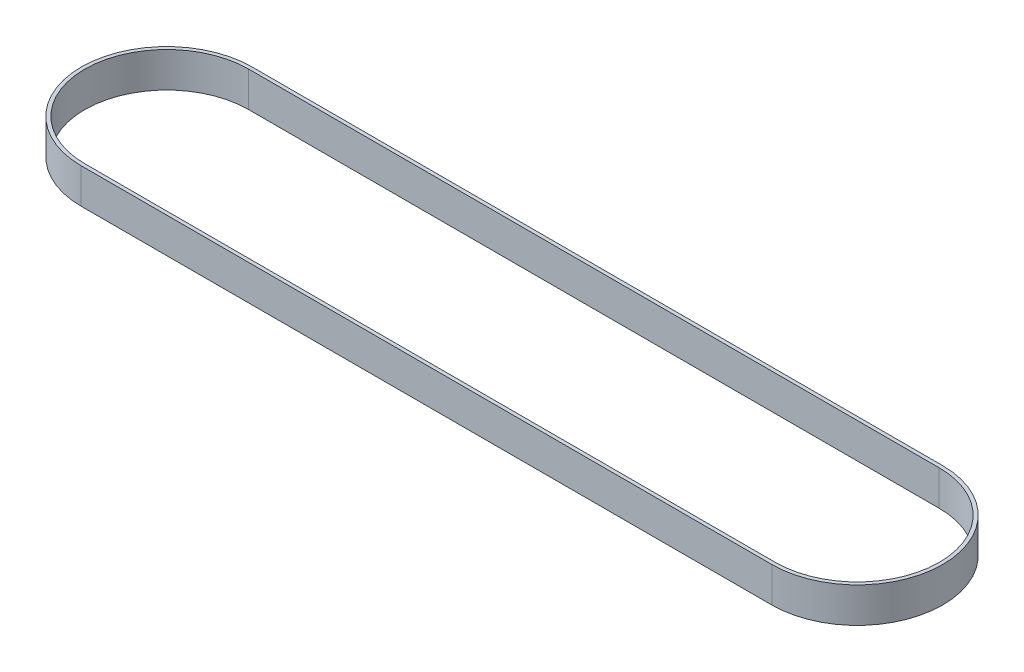
ISO-10303-21;
HEADER;
FILE_DESCRIPTION(('STEP AP214'),'2;1');
FILE_NAME('part.step','',(''),(''),'','','');
FILE_SCHEMA(('AUTOMOTIVE_DESIGN { 1 0 10303 214 1 1 1 1 }'));
ENDSEC;
DATA;
#1=APPLICATION_CONTEXT('core data for automotive mechanical design processes');
#2=APPLICATION_PROTOCOL_DEFINITION('international standard','automotive_design',2000,#1);
#3=PRODUCT_CONTEXT('',#1,'mechanical');
#4=PRODUCT('Part','Part','',(#3));
#5=PRODUCT_RELATED_PRODUCT_CATEGORY('part','',(#4));
#6=PRODUCT_DEFINITION_FORMATION('','',#4);
#7=PRODUCT_DEFINITION_CONTEXT('part definition',#1,'design');
#8=PRODUCT_DEFINITION('design','',#6,#7);
#9=PRODUCT_DEFINITION_SHAPE('','',#8);
#10=(LENGTH_UNIT() NAMED_UNIT(*) SI_UNIT(.MILLI.,.METRE.));
#11=(NAMED_UNIT(*) PLANE_ANGLE_UNIT() SI_UNIT($,.RADIAN.));
#12=(NAMED_UNIT(*) SI_UNIT($,.STERADIAN.) SOLID_ANGLE_UNIT());
#13=UNCERTAINTY_MEASURE_WITH_UNIT(LENGTH_MEASURE(1.E-05),#10,'distance_accuracy_value','');
#14=(GEOMETRIC_REPRESENTATION_CONTEXT(3) GLOBAL_UNCERTAINTY_ASSIGNED_CONTEXT((#13)) GLOBAL_UNIT_ASSIGNED_CONTEXT((#10,
#11,#12)) REPRESENTATION_CONTEXT('',''));
#15=CARTESIAN_POINT('',(0.,0.,0.));
#16=DIRECTION('',(0.,0.,1.));
#17=DIRECTION('',(1.,0.,0.));
#18=AXIS2_PLACEMENT_3D('',#15,#16,#17);
#19=CARTESIAN_POINT('',(0.,15.,-36.5379));
#20=DIRECTION('',(0.,0.,1.));
#21=DIRECTION('',(1.,0.,0.));
#22=AXIS2_PLACEMENT_3D('',#19,#20,#21);
#23=PLANE('',#22);
#24=DIRECTION('',(0.,-1.,0.));
#25=VECTOR('',#24,1.);
#26=CARTESIAN_POINT('',(0.,15.,-36.5379));
#27=LINE('',#26,#25);
#28=CARTESIAN_POINT('',(0.,15.,-36.5379));
#29=VERTEX_POINT('',#28);
#30=CARTESIAN_POINT('',(0.,0.,-36.5379));
#31=VERTEX_POINT('',#30);
#32=EDGE_CURVE('E63',#29,#31,#27,.T.);
#33=ORIENTED_EDGE('',*,*,#32,.F.);
#34=DIRECTION('',(1.,0.,0.));
#35=VECTOR('',#34,1.);
#36=CARTESIAN_POINT('',(0.,15.,-36.5379));
#37=LINE('',#36,#35);
#38=CARTESIAN_POINT('',(295.0718,15.,-36.5379));
#39=VERTEX_POINT('',#38);
#40=EDGE_CURVE('E65',#39,#29,#37,.F.);
#41=ORIENTED_EDGE('',*,*,#40,.F.);
#42=DIRECTION('',(0.,-1.,0.));
#43=VECTOR('',#42,1.);
#44=CARTESIAN_POINT('',(295.0718,15.,-36.5379));
#45=LINE('',#44,#43);
#46=CARTESIAN_POINT('',(295.0718,0.,-36.5379));
#47=VERTEX_POINT('',#46);
#48=EDGE_CURVE('E113',#47,#39,#45,.F.);
#49=ORIENTED_EDGE('',*,*,#48,.F.);
#50=DIRECTION('',(1.,0.,0.));
#51=VECTOR('',#50,1.);
#52=CARTESIAN_POINT('',(0.,0.,-36.5379));
#53=LINE('',#52,#51);
#54=EDGE_CURVE('E67',#47,#31,#53,.F.);
#55=ORIENTED_EDGE('',*,*,#54,.T.);
#56=EDGE_LOOP('',(#33,#41,#49,#55));
#57=FACE_BOUND('',#56,.T.);
#58=ADVANCED_FACE('F14',(#57),#23,.F.);
#59=CARTESIAN_POINT('',(0.,15.,-35.0139));
#60=DIRECTION('',(0.,0.,1.));
#61=DIRECTION('',(1.,0.,0.));
#62=AXIS2_PLACEMENT_3D('',#59,#60,#61);
#63=PLANE('',#62);
#64=DIRECTION('',(1.,0.,0.));
#65=VECTOR('',#64,1.);
#66=CARTESIAN_POINT('',(0.,15.,-35.0139));
#67=LINE('',#66,#65);
#68=CARTESIAN_POINT('',(0.,15.,-35.0139));
#69=VERTEX_POINT('',#68);
#70=CARTESIAN_POINT('',(295.0718,15.,-35.0139));
#71=VERTEX_POINT('',#70);
#72=EDGE_CURVE('E97',#69,#71,#67,.T.);
#73=ORIENTED_EDGE('',*,*,#72,.F.);
#74=DIRECTION('',(0.,-1.,0.));
#75=VECTOR('',#74,1.);
#76=CARTESIAN_POINT('',(0.,15.,-35.0139));
#77=LINE('',#76,#75);
#78=CARTESIAN_POINT('',(0.,0.,-35.0139));
#79=VERTEX_POINT('',#78);
#80=EDGE_CURVE('E72',#69,#79,#77,.T.);
#81=ORIENTED_EDGE('',*,*,#80,.T.);
#82=DIRECTION('',(1.,0.,0.));
#83=VECTOR('',#82,1.);
#84=CARTESIAN_POINT('',(0.,0.,-35.0139));
#85=LINE('',#84,#83);
#86=CARTESIAN_POINT('',(295.0718,0.,-35.0139));
#87=VERTEX_POINT('',#86);
#88=EDGE_CURVE('E118',#79,#87,#85,.T.);
#89=ORIENTED_EDGE('',*,*,#88,.T.);
#90=DIRECTION('',(0.,-1.,0.));
#91=VECTOR('',#90,1.);
#92=CARTESIAN_POINT('',(295.0718,15.,-35.0139));
#93=LINE('',#92,#91);
#94=EDGE_CURVE('E110',#87,#71,#93,.F.);
#95=ORIENTED_EDGE('',*,*,#94,.T.);
#96=EDGE_LOOP('',(#73,#81,#89,#95));
#97=FACE_BOUND('',#96,.T.);
#98=ADVANCED_FACE('F131',(#97),#63,.T.);
#99=CARTESIAN_POINT('',(295.0718,15.,0.));
#100=DIRECTION('',(0.,-1.,0.));
#101=DIRECTION('',(0.,0.,-1.));
#102=AXIS2_PLACEMENT_3D('',#99,#100,#101);
#103=CYLINDRICAL_SURFACE('',#102,35.0139);
#104=DIRECTION('',(0.,1.,0.));
#105=VECTOR('',#104,1.);
#106=CARTESIAN_POINT('',(295.0718,15.,35.0139));
#107=LINE('',#106,#105);
#108=CARTESIAN_POINT('',(295.0718,15.,35.0139));
#109=VERTEX_POINT('',#108);
#110=CARTESIAN_POINT('',(295.0718,0.,35.0139));
#111=VERTEX_POINT('',#110);
#112=EDGE_CURVE('E107',#109,#111,#107,.F.);
#113=ORIENTED_EDGE('',*,*,#112,.F.);
#114=CARTESIAN_POINT('',(295.0718,15.,0.));
#115=DIRECTION('',(0.,-1.,0.));
#116=DIRECTION('',(0.,0.,-1.));
#117=AXIS2_PLACEMENT_3D('',#114,#115,#116);
#118=CIRCLE('',#117,35.0139);
#119=EDGE_CURVE('E99',#71,#109,#118,.T.);
#120=ORIENTED_EDGE('',*,*,#119,.F.);
#121=ORIENTED_EDGE('',*,*,#94,.F.);
#122=CARTESIAN_POINT('',(295.0718,0.,0.));
#123=DIRECTION('',(0.,-1.,0.));
#124=DIRECTION('',(0.,0.,-1.));
#125=AXIS2_PLACEMENT_3D('',#122,#123,#124);
#126=CIRCLE('',#125,35.0139);
#127=EDGE_CURVE('E115',#87,#111,#126,.T.);
#128=ORIENTED_EDGE('',*,*,#127,.T.);
#129=EDGE_LOOP('',(#113,#120,#121,#128));
#130=FACE_BOUND('',#129,.T.);
#131=ADVANCED_FACE('F140',(#130),#103,.F.);
#132=CARTESIAN_POINT('',(0.,15.,35.0139));
#133=DIRECTION('',(0.,0.,-1.));
#134=DIRECTION('',(-1.,0.,0.));
#135=AXIS2_PLACEMENT_3D('',#132,#133,#134);
#136=PLANE('',#135);
#137=DIRECTION('',(1.,0.,0.));
#138=VECTOR('',#137,1.);
#139=CARTESIAN_POINT('',(0.,15.,35.0139));
#140=LINE('',#139,#138);
#141=CARTESIAN_POINT('',(0.,15.,35.0139));
#142=VERTEX_POINT('',#141);
#143=EDGE_CURVE('E80',#109,#142,#140,.F.);
#144=ORIENTED_EDGE('',*,*,#143,.F.);
#145=ORIENTED_EDGE('',*,*,#112,.T.);
#146=DIRECTION('',(1.,0.,0.));
#147=VECTOR('',#146,1.);
#148=CARTESIAN_POINT('',(0.,0.,35.0139));
#149=LINE('',#148,#147);
#150=CARTESIAN_POINT('',(0.,0.,35.0139));
#151=VERTEX_POINT('',#150);
#152=EDGE_CURVE('E93',#111,#151,#149,.F.);
#153=ORIENTED_EDGE('',*,*,#152,.T.);
#154=DIRECTION('',(0.,-1.,0.));
#155=VECTOR('',#154,1.);
#156=CARTESIAN_POINT('',(0.,15.,35.0139));
#157=LINE('',#156,#155);
#158=EDGE_CURVE('E104',#151,#142,#157,.F.);
#159=ORIENTED_EDGE('',*,*,#158,.T.);
#160=EDGE_LOOP('',(#144,#145,#153,#159));
#161=FACE_BOUND('',#160,.T.);
#162=ADVANCED_FACE('F142',(#161),#136,.T.);
#163=CARTESIAN_POINT('',(0.,15.,0.));
#164=DIRECTION('',(0.,-1.,0.));
#165=DIRECTION('',(0.,0.,-1.));
#166=AXIS2_PLACEMENT_3D('',#163,#164,#165);
#167=CYLINDRICAL_SURFACE('',#166,35.0139);
#168=ORIENTED_EDGE('',*,*,#80,.F.);
#169=CARTESIAN_POINT('',(0.,15.,0.));
#170=DIRECTION('',(0.,-1.,0.));
#171=DIRECTION('',(0.,0.,-1.));
#172=AXIS2_PLACEMENT_3D('',#169,#170,#171);
#173=CIRCLE('',#172,35.0139);
#174=EDGE_CURVE('E100',#142,#69,#173,.T.);
#175=ORIENTED_EDGE('',*,*,#174,.F.);
#176=ORIENTED_EDGE('',*,*,#158,.F.);
#177=CARTESIAN_POINT('',(0.,0.,0.));
#178=DIRECTION('',(0.,-1.,0.));
#179=DIRECTION('',(0.,0.,-1.));
#180=AXIS2_PLACEMENT_3D('',#177,#178,#179);
#181=CIRCLE('',#180,35.0139);
#182=EDGE_CURVE('E89',#151,#79,#181,.T.);
#183=ORIENTED_EDGE('',*,*,#182,.T.);
#184=EDGE_LOOP('',(#168,#175,#176,#183));
#185=FACE_BOUND('',#184,.T.);
#186=ADVANCED_FACE('F148',(#185),#167,.F.);
#187=CARTESIAN_POINT('',(0.,15.,0.));
#188=DIRECTION('',(0.,-1.,0.));
#189=DIRECTION('',(0.,0.,-1.));
#190=AXIS2_PLACEMENT_3D('',#187,#188,#189);
#191=CYLINDRICAL_SURFACE('',#190,36.5379);
#192=CARTESIAN_POINT('',(0.,15.,0.));
#193=DIRECTION('',(0.,-1.,0.));
#194=DIRECTION('',(0.,0.,-1.));
#195=AXIS2_PLACEMENT_3D('',#192,#193,#194);
#196=CIRCLE('',#195,36.5379);
#197=CARTESIAN_POINT('',(0.,15.,36.5379));
#198=VERTEX_POINT('',#197);
#199=EDGE_CURVE('E17',#29,#198,#196,.F.);
#200=ORIENTED_EDGE('',*,*,#199,.F.);
#201=ORIENTED_EDGE('',*,*,#32,.T.);
#202=CARTESIAN_POINT('',(0.,0.,0.));
#203=DIRECTION('',(0.,-1.,0.));
#204=DIRECTION('',(0.,0.,-1.));
#205=AXIS2_PLACEMENT_3D('',#202,#203,#204);
#206=CIRCLE('',#205,36.5379);
#207=CARTESIAN_POINT('',(0.,0.,36.5379));
#208=VERTEX_POINT('',#207);
#209=EDGE_CURVE('E86',#31,#208,#206,.F.);
#210=ORIENTED_EDGE('',*,*,#209,.T.);
#211=DIRECTION('',(0.,1.,0.));
#212=VECTOR('',#211,1.);
#213=CARTESIAN_POINT('',(0.,15.,36.5379));
#214=LINE('',#213,#212);
#215=EDGE_CURVE('E85',#208,#198,#214,.T.);
#216=ORIENTED_EDGE('',*,*,#215,.T.);
#217=EDGE_LOOP('',(#200,#201,#210,#216));
#218=FACE_BOUND('',#217,.T.);
#219=ADVANCED_FACE('F83',(#218),#191,.T.);
#220=CARTESIAN_POINT('',(0.,15.,0.));
#221=DIRECTION('',(0.,1.,0.));
#222=DIRECTION('',(0.,0.,1.));
#223=AXIS2_PLACEMENT_3D('',#220,#221,#222);
#224=PLANE('',#223);
#225=ORIENTED_EDGE('',*,*,#72,.T.);
#226=ORIENTED_EDGE('',*,*,#119,.T.);
#227=ORIENTED_EDGE('',*,*,#143,.T.);
#228=ORIENTED_EDGE('',*,*,#174,.T.);
#229=EDGE_LOOP('',(#225,#226,#227,#228));
#230=FACE_BOUND('',#229,.T.);
#231=CARTESIAN_POINT('',(295.0718,15.,0.));
#232=DIRECTION('',(0.,-1.,0.));
#233=DIRECTION('',(0.,0.,-1.));
#234=AXIS2_PLACEMENT_3D('',#231,#232,#233);
#235=CIRCLE('',#234,36.5379);
#236=CARTESIAN_POINT('',(295.0718,15.,36.5379));
#237=VERTEX_POINT('',#236);
#238=EDGE_CURVE('E79',#39,#237,#235,.T.);
#239=ORIENTED_EDGE('',*,*,#238,.F.);
#240=ORIENTED_EDGE('',*,*,#40,.T.);
#241=ORIENTED_EDGE('',*,*,#199,.T.);
#242=DIRECTION('',(-1.,0.,0.));
#243=VECTOR('',#242,1.);
#244=CARTESIAN_POINT('',(0.,15.,36.5379));
#245=LINE('',#244,#243);
#246=EDGE_CURVE('E88',#198,#237,#245,.F.);
#247=ORIENTED_EDGE('',*,*,#246,.T.);
#248=EDGE_LOOP('',(#239,#240,#241,#247));
#249=FACE_BOUND('',#248,.T.);
#250=ADVANCED_FACE('F76',(#230,#249),#224,.T.);
#251=CARTESIAN_POINT('',(295.0718,15.,0.));
#252=DIRECTION('',(0.,-1.,0.));
#253=DIRECTION('',(0.,0.,-1.));
#254=AXIS2_PLACEMENT_3D('',#251,#252,#253);
#255=CYLINDRICAL_SURFACE('',#254,36.5379);
#256=ORIENTED_EDGE('',*,*,#238,.T.);
#257=DIRECTION('',(0.,1.,0.));
#258=VECTOR('',#257,1.);
#259=CARTESIAN_POINT('',(295.0718,15.,36.5379));
#260=LINE('',#259,#258);
#261=CARTESIAN_POINT('',(295.0718,0.,36.5379));
#262=VERTEX_POINT('',#261);
#263=EDGE_CURVE('E23',#237,#262,#260,.F.);
#264=ORIENTED_EDGE('',*,*,#263,.T.);
#265=CARTESIAN_POINT('',(295.0718,0.,0.));
#266=DIRECTION('',(0.,-1.,0.));
#267=DIRECTION('',(0.,0.,-1.));
#268=AXIS2_PLACEMENT_3D('',#265,#266,#267);
#269=CIRCLE('',#268,36.5379);
#270=EDGE_CURVE('E31',#262,#47,#269,.F.);
#271=ORIENTED_EDGE('',*,*,#270,.T.);
#272=ORIENTED_EDGE('',*,*,#48,.T.);
#273=EDGE_LOOP('',(#256,#264,#271,#272));
#274=FACE_BOUND('',#273,.T.);
#275=ADVANCED_FACE('F159',(#274),#255,.T.);
#276=CARTESIAN_POINT('',(0.,0.,0.));
#277=DIRECTION('',(0.,1.,0.));
#278=DIRECTION('',(0.,0.,1.));
#279=AXIS2_PLACEMENT_3D('',#276,#277,#278);
#280=PLANE('',#279);
#281=ORIENTED_EDGE('',*,*,#152,.F.);
#282=ORIENTED_EDGE('',*,*,#127,.F.);
#283=ORIENTED_EDGE('',*,*,#88,.F.);
#284=ORIENTED_EDGE('',*,*,#182,.F.);
#285=EDGE_LOOP('',(#281,#282,#283,#284));
#286=FACE_BOUND('',#285,.T.);
#287=ORIENTED_EDGE('',*,*,#54,.F.);
#288=ORIENTED_EDGE('',*,*,#270,.F.);
#289=DIRECTION('',(-1.,0.,0.));
#290=VECTOR('',#289,1.);
#291=CARTESIAN_POINT('',(0.,0.,36.5379));
#292=LINE('',#291,#290);
#293=EDGE_CURVE('E9',#262,#208,#292,.T.);
#294=ORIENTED_EDGE('',*,*,#293,.T.);
#295=ORIENTED_EDGE('',*,*,#209,.F.);
#296=EDGE_LOOP('',(#287,#288,#294,#295));
#297=FACE_BOUND('',#296,.T.);
#298=ADVANCED_FACE('F151',(#286,#297),#280,.F.);
#299=CARTESIAN_POINT('',(0.,15.,36.5379));
#300=DIRECTION('',(0.,0.,-1.));
#301=DIRECTION('',(-1.,0.,0.));
#302=AXIS2_PLACEMENT_3D('',#299,#300,#301);
#303=PLANE('',#302);
#304=ORIENTED_EDGE('',*,*,#263,.F.);
#305=ORIENTED_EDGE('',*,*,#246,.F.);
#306=ORIENTED_EDGE('',*,*,#215,.F.);
#307=ORIENTED_EDGE('',*,*,#293,.F.);
#308=EDGE_LOOP('',(#304,#305,#306,#307));
#309=FACE_BOUND('',#308,.T.);
#310=ADVANCED_FACE('F160',(#309),#303,.F.);
#311=CLOSED_SHELL('',(#58,#98,#131,#162,#186,#219,#250,#275,#298,#310));
#312=MANIFOLD_SOLID_BREP('B1',#311);
#313=ADVANCED_BREP_SHAPE_REPRESENTATION('',(#18,#312),#14);
#314=SHAPE_DEFINITION_REPRESENTATION(#9,#313);
ENDSEC;
END-ISO-10303-21;
